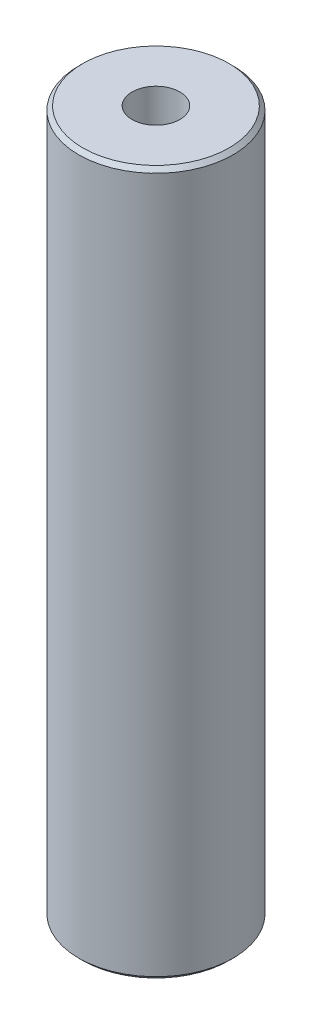
ISO-10303-21;
HEADER;
FILE_DESCRIPTION(('STEP AP214'),'2;1');
FILE_NAME('part.step','',(''),(''),'','','');
FILE_SCHEMA(('AUTOMOTIVE_DESIGN { 1 0 10303 214 1 1 1 1 }'));
ENDSEC;
DATA;
#1=APPLICATION_CONTEXT('core data for automotive mechanical design processes');
#2=APPLICATION_PROTOCOL_DEFINITION('international standard','automotive_design',2000,#1);
#3=PRODUCT_CONTEXT('',#1,'mechanical');
#4=PRODUCT('Part','Part','',(#3));
#5=PRODUCT_RELATED_PRODUCT_CATEGORY('part','',(#4));
#6=PRODUCT_DEFINITION_FORMATION('','',#4);
#7=PRODUCT_DEFINITION_CONTEXT('part definition',#1,'design');
#8=PRODUCT_DEFINITION('design','',#6,#7);
#9=PRODUCT_DEFINITION_SHAPE('','',#8);
#10=(LENGTH_UNIT() NAMED_UNIT(*) SI_UNIT(.MILLI.,.METRE.));
#11=(NAMED_UNIT(*) PLANE_ANGLE_UNIT() SI_UNIT($,.RADIAN.));
#12=(NAMED_UNIT(*) SI_UNIT($,.STERADIAN.) SOLID_ANGLE_UNIT());
#13=UNCERTAINTY_MEASURE_WITH_UNIT(LENGTH_MEASURE(1.E-05),#10,'distance_accuracy_value','');
#14=(GEOMETRIC_REPRESENTATION_CONTEXT(3) GLOBAL_UNCERTAINTY_ASSIGNED_CONTEXT((#13)) GLOBAL_UNIT_ASSIGNED_CONTEXT((#10,
#11,#12)) REPRESENTATION_CONTEXT('',''));
#15=CARTESIAN_POINT('',(0.,0.,0.));
#16=DIRECTION('',(0.,0.,1.));
#17=DIRECTION('',(1.,0.,0.));
#18=AXIS2_PLACEMENT_3D('',#15,#16,#17);
#19=CARTESIAN_POINT('',(0.,547.333783928571,0.));
#20=DIRECTION('',(0.,-1.,0.));
#21=DIRECTION('',(0.,0.,-1.));
#22=AXIS2_PLACEMENT_3D('',#19,#20,#21);
#23=CYLINDRICAL_SURFACE('',#22,60.);
#24=CARTESIAN_POINT('',(0.,544.219991561709,0.));
#25=DIRECTION('',(0.,1.,0.));
#26=DIRECTION('',(0.,0.,1.));
#27=AXIS2_PLACEMENT_3D('',#24,#25,#26);
#28=CIRCLE('',#27,60.);
#29=CARTESIAN_POINT('',(0.,544.219991561709,60.));
#30=VERTEX_POINT('',#29);
#31=EDGE_CURVE('E50',#30,#30,#28,.F.);
#32=ORIENTED_EDGE('',*,*,#31,.T.);
#33=EDGE_LOOP('',(#32));
#34=FACE_BOUND('',#33,.T.);
#35=CARTESIAN_POINT('',(0.,3.11379236686182,0.));
#36=DIRECTION('',(0.,1.,0.));
#37=DIRECTION('',(0.,0.,1.));
#38=AXIS2_PLACEMENT_3D('',#35,#36,#37);
#39=CIRCLE('',#38,60.);
#40=CARTESIAN_POINT('',(0.,3.11379236686182,60.));
#41=VERTEX_POINT('',#40);
#42=EDGE_CURVE('E51',#41,#41,#39,.T.);
#43=ORIENTED_EDGE('',*,*,#42,.T.);
#44=EDGE_LOOP('',(#43));
#45=FACE_BOUND('',#44,.T.);
#46=ADVANCED_FACE('F39',(#34,#45),#23,.T.);
#47=CARTESIAN_POINT('',(0.,547.333783928571,0.));
#48=DIRECTION('',(0.,1.,0.));
#49=DIRECTION('',(0.,0.,1.));
#50=AXIS2_PLACEMENT_3D('',#47,#48,#49);
#51=PLANE('',#50);
#52=CARTESIAN_POINT('',(0.,547.333783928571,0.));
#53=DIRECTION('',(0.,1.,0.));
#54=DIRECTION('',(0.,0.,1.));
#55=AXIS2_PLACEMENT_3D('',#52,#53,#54);
#56=CIRCLE('',#55,56.886207633138);
#57=CARTESIAN_POINT('',(0.,547.333783928571,56.886207633138));
#58=VERTEX_POINT('',#57);
#59=EDGE_CURVE('E54',#58,#58,#56,.T.);
#60=ORIENTED_EDGE('',*,*,#59,.T.);
#61=EDGE_LOOP('',(#60));
#62=FACE_BOUND('',#61,.T.);
#63=CARTESIAN_POINT('',(0.,547.333783928571,0.));
#64=DIRECTION('',(0.,1.,0.));
#65=DIRECTION('',(0.,0.,1.));
#66=AXIS2_PLACEMENT_3D('',#63,#64,#65);
#67=CIRCLE('',#66,18.59516651959);
#68=CARTESIAN_POINT('',(0.,547.333783928571,18.59516651959));
#69=VERTEX_POINT('',#68);
#70=EDGE_CURVE('E58',#69,#69,#67,.T.);
#71=ORIENTED_EDGE('',*,*,#70,.F.);
#72=EDGE_LOOP('',(#71));
#73=FACE_BOUND('',#72,.T.);
#74=ADVANCED_FACE('F69',(#62,#73),#51,.T.);
#75=CARTESIAN_POINT('',(0.,0.,0.));
#76=DIRECTION('',(0.,1.,0.));
#77=DIRECTION('',(0.,0.,1.));
#78=AXIS2_PLACEMENT_3D('',#75,#76,#77);
#79=PLANE('',#78);
#80=CARTESIAN_POINT('',(0.,0.,0.));
#81=DIRECTION('',(0.,1.,0.));
#82=DIRECTION('',(0.,0.,1.));
#83=AXIS2_PLACEMENT_3D('',#80,#81,#82);
#84=CIRCLE('',#83,56.8862076331382);
#85=CARTESIAN_POINT('',(0.,0.,56.8862076331382));
#86=VERTEX_POINT('',#85);
#87=EDGE_CURVE('E10',#86,#86,#84,.F.);
#88=ORIENTED_EDGE('',*,*,#87,.T.);
#89=EDGE_LOOP('',(#88));
#90=FACE_BOUND('',#89,.T.);
#91=CARTESIAN_POINT('',(0.,0.,0.));
#92=DIRECTION('',(0.,1.,0.));
#93=DIRECTION('',(0.,0.,1.));
#94=AXIS2_PLACEMENT_3D('',#91,#92,#93);
#95=CIRCLE('',#94,18.59516651959);
#96=CARTESIAN_POINT('',(0.,0.,18.59516651959));
#97=VERTEX_POINT('',#96);
#98=EDGE_CURVE('E63',#97,#97,#95,.T.);
#99=ORIENTED_EDGE('',*,*,#98,.T.);
#100=EDGE_LOOP('',(#99));
#101=FACE_BOUND('',#100,.T.);
#102=ADVANCED_FACE('F75',(#90,#101),#79,.F.);
#103=CARTESIAN_POINT('',(0.,547.333783928571,0.));
#104=DIRECTION('',(0.,-1.,0.));
#105=DIRECTION('',(0.,0.,-1.));
#106=AXIS2_PLACEMENT_3D('',#103,#104,#105);
#107=CYLINDRICAL_SURFACE('',#106,18.59516651959);
#108=ORIENTED_EDGE('',*,*,#70,.T.);
#109=EDGE_LOOP('',(#108));
#110=FACE_BOUND('',#109,.T.);
#111=ORIENTED_EDGE('',*,*,#98,.F.);
#112=EDGE_LOOP('',(#111));
#113=FACE_BOUND('',#112,.T.);
#114=ADVANCED_FACE('F70',(#110,#113),#107,.F.);
#115=CARTESIAN_POINT('',(0.,547.333783928571,0.));
#116=DIRECTION('',(0.,-1.,0.));
#117=DIRECTION('',(0.,0.,-1.));
#118=AXIS2_PLACEMENT_3D('',#115,#116,#117);
#119=CONICAL_SURFACE('',#118,56.886207633138,0.785398163397439);
#120=ORIENTED_EDGE('',*,*,#31,.F.);
#121=EDGE_LOOP('',(#120));
#122=FACE_BOUND('',#121,.T.);
#123=ORIENTED_EDGE('',*,*,#59,.F.);
#124=EDGE_LOOP('',(#123));
#125=FACE_BOUND('',#124,.T.);
#126=ADVANCED_FACE('F81',(#122,#125),#119,.T.);
#127=CARTESIAN_POINT('',(0.,3.11379236686182,0.));
#128=DIRECTION('',(0.,1.,0.));
#129=DIRECTION('',(0.,0.,1.));
#130=AXIS2_PLACEMENT_3D('',#127,#128,#129);
#131=CONICAL_SURFACE('',#130,60.,0.785398163397448);
#132=ORIENTED_EDGE('',*,*,#87,.F.);
#133=EDGE_LOOP('',(#132));
#134=FACE_BOUND('',#133,.T.);
#135=ORIENTED_EDGE('',*,*,#42,.F.);
#136=EDGE_LOOP('',(#135));
#137=FACE_BOUND('',#136,.T.);
#138=ADVANCED_FACE('F45',(#134,#137),#131,.T.);
#139=CLOSED_SHELL('',(#46,#74,#102,#114,#126,#138));
#140=MANIFOLD_SOLID_BREP('B2',#139);
#141=ADVANCED_BREP_SHAPE_REPRESENTATION('',(#18,#140),#14);
#142=SHAPE_DEFINITION_REPRESENTATION(#9,#141);
ENDSEC;
END-ISO-10303-21;
